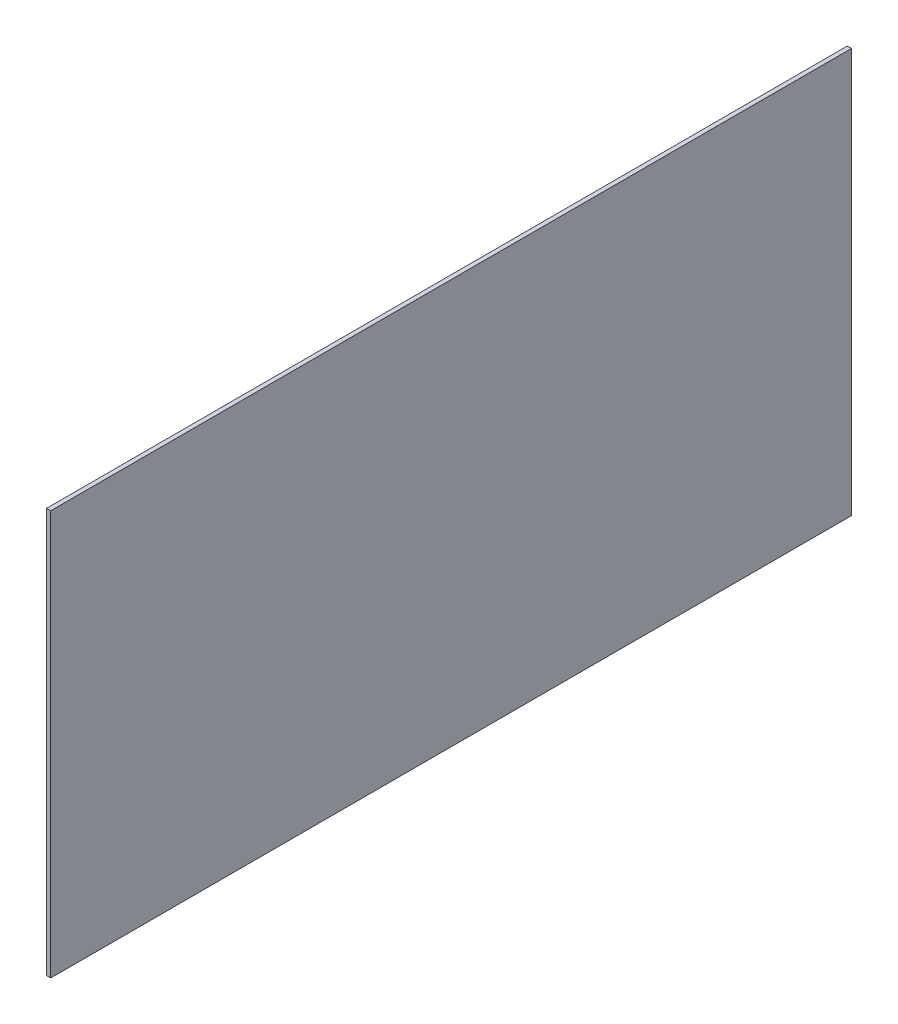
ISO-10303-21;
HEADER;
FILE_DESCRIPTION(('STEP AP214'),'2;1');
FILE_NAME('part.step','',(''),(''),'','','');
FILE_SCHEMA(('AUTOMOTIVE_DESIGN { 1 0 10303 214 1 1 1 1 }'));
ENDSEC;
DATA;
#1=APPLICATION_CONTEXT('core data for automotive mechanical design processes');
#2=APPLICATION_PROTOCOL_DEFINITION('international standard','automotive_design',2000,#1);
#3=PRODUCT_CONTEXT('',#1,'mechanical');
#4=PRODUCT('Part','Part','',(#3));
#5=PRODUCT_RELATED_PRODUCT_CATEGORY('part','',(#4));
#6=PRODUCT_DEFINITION_FORMATION('','',#4);
#7=PRODUCT_DEFINITION_CONTEXT('part definition',#1,'design');
#8=PRODUCT_DEFINITION('design','',#6,#7);
#9=PRODUCT_DEFINITION_SHAPE('','',#8);
#10=(LENGTH_UNIT() NAMED_UNIT(*) SI_UNIT(.MILLI.,.METRE.));
#11=(NAMED_UNIT(*) PLANE_ANGLE_UNIT() SI_UNIT($,.RADIAN.));
#12=(NAMED_UNIT(*) SI_UNIT($,.STERADIAN.) SOLID_ANGLE_UNIT());
#13=UNCERTAINTY_MEASURE_WITH_UNIT(LENGTH_MEASURE(1.E-05),#10,'distance_accuracy_value','');
#14=(GEOMETRIC_REPRESENTATION_CONTEXT(3) GLOBAL_UNCERTAINTY_ASSIGNED_CONTEXT((#13)) GLOBAL_UNIT_ASSIGNED_CONTEXT((#10,
#11,#12)) REPRESENTATION_CONTEXT('',''));
#15=CARTESIAN_POINT('',(0.,0.,0.));
#16=DIRECTION('',(0.,0.,1.));
#17=DIRECTION('',(1.,0.,0.));
#18=AXIS2_PLACEMENT_3D('',#15,#16,#17);
#19=CARTESIAN_POINT('',(3.175,152.4,-304.8));
#20=DIRECTION('',(0.,-1.,0.));
#21=DIRECTION('',(0.,0.,-1.));
#22=AXIS2_PLACEMENT_3D('',#19,#20,#21);
#23=PLANE('',#22);
#24=DIRECTION('',(1.,0.,0.));
#25=VECTOR('',#24,1.);
#26=CARTESIAN_POINT('',(3.175,152.4,-298.45));
#27=LINE('',#26,#25);
#28=CARTESIAN_POINT('',(0.,152.4,-298.45));
#29=VERTEX_POINT('',#28);
#30=CARTESIAN_POINT('',(3.175,152.4,-298.45));
#31=VERTEX_POINT('',#30);
#32=EDGE_CURVE('E84',#29,#31,#27,.T.);
#33=ORIENTED_EDGE('',*,*,#32,.F.);
#34=DIRECTION('',(0.,0.,1.));
#35=VECTOR('',#34,1.);
#36=CARTESIAN_POINT('',(0.,152.4,-304.8));
#37=LINE('',#36,#35);
#38=CARTESIAN_POINT('',(0.,152.4,304.8));
#39=VERTEX_POINT('',#38);
#40=EDGE_CURVE('E82',#29,#39,#37,.T.);
#41=ORIENTED_EDGE('',*,*,#40,.T.);
#42=DIRECTION('',(-1.,0.,0.));
#43=VECTOR('',#42,1.);
#44=CARTESIAN_POINT('',(3.175,152.4,304.8));
#45=LINE('',#44,#43);
#46=CARTESIAN_POINT('',(3.175,152.4,304.8));
#47=VERTEX_POINT('',#46);
#48=EDGE_CURVE('E11',#47,#39,#45,.T.);
#49=ORIENTED_EDGE('',*,*,#48,.F.);
#50=DIRECTION('',(0.,0.,1.));
#51=VECTOR('',#50,1.);
#52=CARTESIAN_POINT('',(3.175,152.4,-304.8));
#53=LINE('',#52,#51);
#54=EDGE_CURVE('E74',#31,#47,#53,.T.);
#55=ORIENTED_EDGE('',*,*,#54,.F.);
#56=EDGE_LOOP('',(#33,#41,#49,#55));
#57=FACE_BOUND('',#56,.T.);
#58=ADVANCED_FACE('F32',(#57),#23,.F.);
#59=CARTESIAN_POINT('',(3.175,-152.4,-304.8));
#60=DIRECTION('',(0.,-1.,0.));
#61=DIRECTION('',(0.,0.,-1.));
#62=AXIS2_PLACEMENT_3D('',#59,#60,#61);
#63=PLANE('',#62);
#64=DIRECTION('',(0.,0.,1.));
#65=VECTOR('',#64,1.);
#66=CARTESIAN_POINT('',(0.,-152.4,-304.8));
#67=LINE('',#66,#65);
#68=CARTESIAN_POINT('',(0.,-152.4,-298.45));
#69=VERTEX_POINT('',#68);
#70=CARTESIAN_POINT('',(0.,-152.4,304.8));
#71=VERTEX_POINT('',#70);
#72=EDGE_CURVE('E68',#69,#71,#67,.T.);
#73=ORIENTED_EDGE('',*,*,#72,.F.);
#74=DIRECTION('',(-1.,0.,0.));
#75=VECTOR('',#74,1.);
#76=CARTESIAN_POINT('',(3.175,-152.4,-298.45));
#77=LINE('',#76,#75);
#78=CARTESIAN_POINT('',(3.175,-152.4,-298.45));
#79=VERTEX_POINT('',#78);
#80=EDGE_CURVE('E46',#79,#69,#77,.T.);
#81=ORIENTED_EDGE('',*,*,#80,.F.);
#82=DIRECTION('',(0.,0.,1.));
#83=VECTOR('',#82,1.);
#84=CARTESIAN_POINT('',(3.175,-152.4,-304.8));
#85=LINE('',#84,#83);
#86=CARTESIAN_POINT('',(3.175,-152.4,304.8));
#87=VERTEX_POINT('',#86);
#88=EDGE_CURVE('E54',#79,#87,#85,.T.);
#89=ORIENTED_EDGE('',*,*,#88,.T.);
#90=DIRECTION('',(-1.,0.,0.));
#91=VECTOR('',#90,1.);
#92=CARTESIAN_POINT('',(3.175,-152.4,304.8));
#93=LINE('',#92,#91);
#94=EDGE_CURVE('E39',#87,#71,#93,.T.);
#95=ORIENTED_EDGE('',*,*,#94,.T.);
#96=EDGE_LOOP('',(#73,#81,#89,#95));
#97=FACE_BOUND('',#96,.T.);
#98=ADVANCED_FACE('F76',(#97),#63,.T.);
#99=CARTESIAN_POINT('',(3.175,0.,0.));
#100=DIRECTION('',(1.,0.,0.));
#101=DIRECTION('',(0.,0.,-1.));
#102=AXIS2_PLACEMENT_3D('',#99,#100,#101);
#103=PLANE('',#102);
#104=ORIENTED_EDGE('',*,*,#88,.F.);
#105=DIRECTION('',(0.,-1.,0.));
#106=VECTOR('',#105,1.);
#107=CARTESIAN_POINT('',(3.175,152.4,-298.45));
#108=LINE('',#107,#106);
#109=EDGE_CURVE('E95',#31,#79,#108,.T.);
#110=ORIENTED_EDGE('',*,*,#109,.F.);
#111=ORIENTED_EDGE('',*,*,#54,.T.);
#112=DIRECTION('',(0.,1.,0.));
#113=VECTOR('',#112,1.);
#114=CARTESIAN_POINT('',(3.175,-152.4,304.8));
#115=LINE('',#114,#113);
#116=EDGE_CURVE('E88',#87,#47,#115,.T.);
#117=ORIENTED_EDGE('',*,*,#116,.F.);
#118=EDGE_LOOP('',(#104,#110,#111,#117));
#119=FACE_BOUND('',#118,.T.);
#120=ADVANCED_FACE('F104',(#119),#103,.T.);
#121=CARTESIAN_POINT('',(0.,0.,0.));
#122=DIRECTION('',(1.,0.,0.));
#123=DIRECTION('',(0.,0.,-1.));
#124=AXIS2_PLACEMENT_3D('',#121,#122,#123);
#125=PLANE('',#124);
#126=DIRECTION('',(0.,1.,0.));
#127=VECTOR('',#126,1.);
#128=CARTESIAN_POINT('',(0.,152.4,-298.45));
#129=LINE('',#128,#127);
#130=EDGE_CURVE('E73',#69,#29,#129,.T.);
#131=ORIENTED_EDGE('',*,*,#130,.F.);
#132=ORIENTED_EDGE('',*,*,#72,.T.);
#133=DIRECTION('',(0.,1.,0.));
#134=VECTOR('',#133,1.);
#135=CARTESIAN_POINT('',(0.,-152.4,304.8));
#136=LINE('',#135,#134);
#137=EDGE_CURVE('E72',#71,#39,#136,.T.);
#138=ORIENTED_EDGE('',*,*,#137,.T.);
#139=ORIENTED_EDGE('',*,*,#40,.F.);
#140=EDGE_LOOP('',(#131,#132,#138,#139));
#141=FACE_BOUND('',#140,.T.);
#142=ADVANCED_FACE('F69',(#141),#125,.F.);
#143=CARTESIAN_POINT('',(3.175,-152.4,304.8));
#144=DIRECTION('',(0.,0.,1.));
#145=DIRECTION('',(1.,0.,0.));
#146=AXIS2_PLACEMENT_3D('',#143,#144,#145);
#147=PLANE('',#146);
#148=ORIENTED_EDGE('',*,*,#137,.F.);
#149=ORIENTED_EDGE('',*,*,#94,.F.);
#150=ORIENTED_EDGE('',*,*,#116,.T.);
#151=ORIENTED_EDGE('',*,*,#48,.T.);
#152=EDGE_LOOP('',(#148,#149,#150,#151));
#153=FACE_BOUND('',#152,.T.);
#154=ADVANCED_FACE('F80',(#153),#147,.T.);
#155=CARTESIAN_POINT('',(0.,0.,-298.45));
#156=DIRECTION('',(0.,0.,-1.));
#157=DIRECTION('',(-1.,0.,0.));
#158=AXIS2_PLACEMENT_3D('',#155,#156,#157);
#159=PLANE('',#158);
#160=ORIENTED_EDGE('',*,*,#109,.T.);
#161=ORIENTED_EDGE('',*,*,#80,.T.);
#162=ORIENTED_EDGE('',*,*,#130,.T.);
#163=ORIENTED_EDGE('',*,*,#32,.T.);
#164=EDGE_LOOP('',(#160,#161,#162,#163));
#165=FACE_BOUND('',#164,.T.);
#166=ADVANCED_FACE('F98',(#165),#159,.T.);
#167=CLOSED_SHELL('',(#58,#98,#120,#142,#154,#166));
#168=MANIFOLD_SOLID_BREP('B2',#167);
#169=ADVANCED_BREP_SHAPE_REPRESENTATION('',(#18,#168),#14);
#170=SHAPE_DEFINITION_REPRESENTATION(#9,#169);
ENDSEC;
END-ISO-10303-21;
